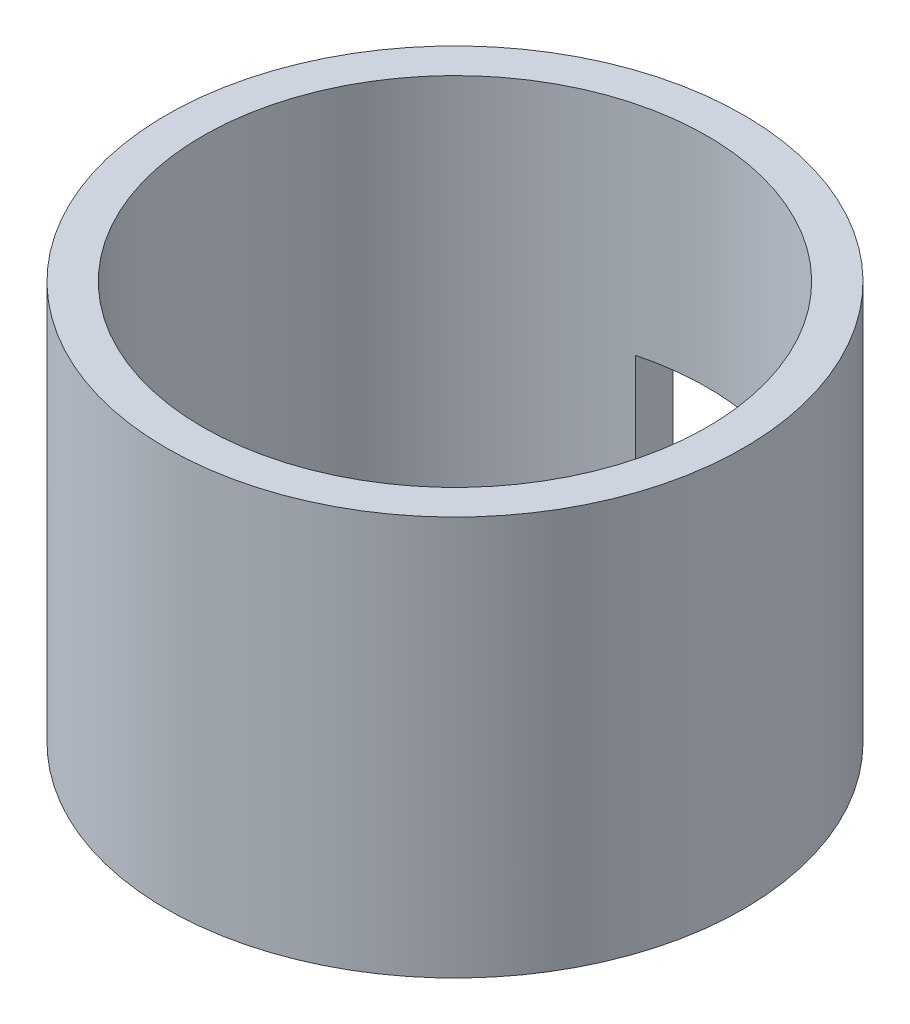
ISO-10303-21;
HEADER;
FILE_DESCRIPTION(('STEP AP214'),'2;1');
FILE_NAME('part.step','',(''),(''),'','','');
FILE_SCHEMA(('AUTOMOTIVE_DESIGN { 1 0 10303 214 1 1 1 1 }'));
ENDSEC;
DATA;
#1=APPLICATION_CONTEXT('core data for automotive mechanical design processes');
#2=APPLICATION_PROTOCOL_DEFINITION('international standard','automotive_design',2000,#1);
#3=PRODUCT_CONTEXT('',#1,'mechanical');
#4=PRODUCT('Part','Part','',(#3));
#5=PRODUCT_RELATED_PRODUCT_CATEGORY('part','',(#4));
#6=PRODUCT_DEFINITION_FORMATION('','',#4);
#7=PRODUCT_DEFINITION_CONTEXT('part definition',#1,'design');
#8=PRODUCT_DEFINITION('design','',#6,#7);
#9=PRODUCT_DEFINITION_SHAPE('','',#8);
#10=(LENGTH_UNIT() NAMED_UNIT(*) SI_UNIT(.MILLI.,.METRE.));
#11=(NAMED_UNIT(*) PLANE_ANGLE_UNIT() SI_UNIT($,.RADIAN.));
#12=(NAMED_UNIT(*) SI_UNIT($,.STERADIAN.) SOLID_ANGLE_UNIT());
#13=UNCERTAINTY_MEASURE_WITH_UNIT(LENGTH_MEASURE(1.E-05),#10,'distance_accuracy_value','');
#14=(GEOMETRIC_REPRESENTATION_CONTEXT(3) GLOBAL_UNCERTAINTY_ASSIGNED_CONTEXT((#13)) GLOBAL_UNIT_ASSIGNED_CONTEXT((#10,
#11,#12)) REPRESENTATION_CONTEXT('',''));
#15=CARTESIAN_POINT('',(0.,0.,0.));
#16=DIRECTION('',(0.,0.,1.));
#17=DIRECTION('',(1.,0.,0.));
#18=AXIS2_PLACEMENT_3D('',#15,#16,#17);
#19=CARTESIAN_POINT('',(0.,22.,0.));
#20=DIRECTION('',(0.,1.,0.));
#21=DIRECTION('',(0.,0.,1.));
#22=AXIS2_PLACEMENT_3D('',#19,#20,#21);
#23=PLANE('',#22);
#24=CARTESIAN_POINT('',(0.,22.,0.));
#25=DIRECTION('',(0.,1.,0.));
#26=DIRECTION('',(0.,0.,1.));
#27=AXIS2_PLACEMENT_3D('',#24,#25,#26);
#28=CIRCLE('',#27,15.9);
#29=CARTESIAN_POINT('',(0.,22.,15.9));
#30=VERTEX_POINT('',#29);
#31=EDGE_CURVE('E100',#30,#30,#28,.T.);
#32=ORIENTED_EDGE('',*,*,#31,.T.);
#33=EDGE_LOOP('',(#32));
#34=FACE_BOUND('',#33,.T.);
#35=CARTESIAN_POINT('',(0.,22.,0.));
#36=DIRECTION('',(0.,1.,0.));
#37=DIRECTION('',(0.,0.,1.));
#38=AXIS2_PLACEMENT_3D('',#35,#36,#37);
#39=CIRCLE('',#38,13.9);
#40=CARTESIAN_POINT('',(0.,22.,13.9));
#41=VERTEX_POINT('',#40);
#42=EDGE_CURVE('E92',#41,#41,#39,.T.);
#43=ORIENTED_EDGE('',*,*,#42,.F.);
#44=EDGE_LOOP('',(#43));
#45=FACE_BOUND('',#44,.T.);
#46=ADVANCED_FACE('F33',(#34,#45),#23,.T.);
#47=CARTESIAN_POINT('',(0.,0.,0.));
#48=DIRECTION('',(0.,1.,0.));
#49=DIRECTION('',(0.,0.,1.));
#50=AXIS2_PLACEMENT_3D('',#47,#48,#49);
#51=PLANE('',#50);
#52=CARTESIAN_POINT('',(0.,0.,0.));
#53=DIRECTION('',(0.,1.,0.));
#54=DIRECTION('',(0.,0.,1.));
#55=AXIS2_PLACEMENT_3D('',#52,#53,#54);
#56=CIRCLE('',#55,13.9);
#57=CARTESIAN_POINT('',(-3.5,0.,-13.4521373766402));
#58=VERTEX_POINT('',#57);
#59=CARTESIAN_POINT('',(3.5,0.,-13.4521373766402));
#60=VERTEX_POINT('',#59);
#61=EDGE_CURVE('E88',#58,#60,#56,.T.);
#62=ORIENTED_EDGE('',*,*,#61,.T.);
#63=DIRECTION('',(0.,0.,-1.));
#64=VECTOR('',#63,1.);
#65=CARTESIAN_POINT('',(3.5,0.,0.));
#66=LINE('',#65,#64);
#67=CARTESIAN_POINT('',(3.5,0.,-15.509996776273));
#68=VERTEX_POINT('',#67);
#69=EDGE_CURVE('E89',#60,#68,#66,.T.);
#70=ORIENTED_EDGE('',*,*,#69,.T.);
#71=CARTESIAN_POINT('',(0.,0.,0.));
#72=DIRECTION('',(0.,1.,0.));
#73=DIRECTION('',(0.,0.,1.));
#74=AXIS2_PLACEMENT_3D('',#71,#72,#73);
#75=CIRCLE('',#74,15.9);
#76=CARTESIAN_POINT('',(-3.5,0.,-15.509996776273));
#77=VERTEX_POINT('',#76);
#78=EDGE_CURVE('E87',#77,#68,#75,.T.);
#79=ORIENTED_EDGE('',*,*,#78,.F.);
#80=DIRECTION('',(0.,0.,1.));
#81=VECTOR('',#80,1.);
#82=CARTESIAN_POINT('',(-3.5,0.,0.));
#83=LINE('',#82,#81);
#84=EDGE_CURVE('E78',#77,#58,#83,.T.);
#85=ORIENTED_EDGE('',*,*,#84,.T.);
#86=EDGE_LOOP('',(#62,#70,#79,#85));
#87=FACE_BOUND('',#86,.T.);
#88=ADVANCED_FACE('F112',(#87),#51,.F.);
#89=CARTESIAN_POINT('',(0.,22.,0.));
#90=DIRECTION('',(0.,-1.,0.));
#91=DIRECTION('',(0.,0.,-1.));
#92=AXIS2_PLACEMENT_3D('',#89,#90,#91);
#93=CYLINDRICAL_SURFACE('',#92,15.9);
#94=ORIENTED_EDGE('',*,*,#78,.T.);
#95=DIRECTION('',(0.,-1.,0.));
#96=VECTOR('',#95,1.);
#97=CARTESIAN_POINT('',(3.5,22.,-15.509996776273));
#98=LINE('',#97,#96);
#99=CARTESIAN_POINT('',(3.5,10.,-15.509996776273));
#100=VERTEX_POINT('',#99);
#101=EDGE_CURVE('E54',#68,#100,#98,.F.);
#102=ORIENTED_EDGE('',*,*,#101,.T.);
#103=CARTESIAN_POINT('',(0.,10.,0.));
#104=DIRECTION('',(0.,1.,0.));
#105=DIRECTION('',(0.,0.,1.));
#106=AXIS2_PLACEMENT_3D('',#103,#104,#105);
#107=CIRCLE('',#106,15.9);
#108=CARTESIAN_POINT('',(-3.5,10.,-15.509996776273));
#109=VERTEX_POINT('',#108);
#110=EDGE_CURVE('E72',#100,#109,#107,.T.);
#111=ORIENTED_EDGE('',*,*,#110,.T.);
#112=DIRECTION('',(0.,-1.,0.));
#113=VECTOR('',#112,1.);
#114=CARTESIAN_POINT('',(-3.5,22.,-15.509996776273));
#115=LINE('',#114,#113);
#116=EDGE_CURVE('E94',#109,#77,#115,.T.);
#117=ORIENTED_EDGE('',*,*,#116,.T.);
#118=EDGE_LOOP('',(#94,#102,#111,#117));
#119=FACE_BOUND('',#118,.T.);
#120=ORIENTED_EDGE('',*,*,#31,.F.);
#121=EDGE_LOOP('',(#120));
#122=FACE_BOUND('',#121,.T.);
#123=ADVANCED_FACE('F35',(#119,#122),#93,.T.);
#124=CARTESIAN_POINT('',(0.,22.,0.));
#125=DIRECTION('',(0.,-1.,0.));
#126=DIRECTION('',(0.,0.,-1.));
#127=AXIS2_PLACEMENT_3D('',#124,#125,#126);
#128=CYLINDRICAL_SURFACE('',#127,13.9);
#129=DIRECTION('',(0.,-1.,0.));
#130=VECTOR('',#129,1.);
#131=CARTESIAN_POINT('',(3.5,22.,-13.4521373766402));
#132=LINE('',#131,#130);
#133=CARTESIAN_POINT('',(3.5,10.,-13.4521373766402));
#134=VERTEX_POINT('',#133);
#135=EDGE_CURVE('E11',#60,#134,#132,.F.);
#136=ORIENTED_EDGE('',*,*,#135,.F.);
#137=ORIENTED_EDGE('',*,*,#61,.F.);
#138=DIRECTION('',(0.,-1.,0.));
#139=VECTOR('',#138,1.);
#140=CARTESIAN_POINT('',(-3.5,22.,-13.4521373766402));
#141=LINE('',#140,#139);
#142=CARTESIAN_POINT('',(-3.5,10.,-13.4521373766402));
#143=VERTEX_POINT('',#142);
#144=EDGE_CURVE('E41',#143,#58,#141,.T.);
#145=ORIENTED_EDGE('',*,*,#144,.F.);
#146=CARTESIAN_POINT('',(0.,10.,0.));
#147=DIRECTION('',(0.,1.,0.));
#148=DIRECTION('',(0.,0.,1.));
#149=AXIS2_PLACEMENT_3D('',#146,#147,#148);
#150=CIRCLE('',#149,13.9);
#151=EDGE_CURVE('E103',#134,#143,#150,.T.);
#152=ORIENTED_EDGE('',*,*,#151,.F.);
#153=EDGE_LOOP('',(#136,#137,#145,#152));
#154=FACE_BOUND('',#153,.T.);
#155=ORIENTED_EDGE('',*,*,#42,.T.);
#156=EDGE_LOOP('',(#155));
#157=FACE_BOUND('',#156,.T.);
#158=ADVANCED_FACE('F114',(#154,#157),#128,.F.);
#159=CARTESIAN_POINT('',(3.5,-10.,-22.));
#160=DIRECTION('',(1.,0.,0.));
#161=DIRECTION('',(0.,0.,-1.));
#162=AXIS2_PLACEMENT_3D('',#159,#160,#161);
#163=PLANE('',#162);
#164=ORIENTED_EDGE('',*,*,#69,.F.);
#165=ORIENTED_EDGE('',*,*,#135,.T.);
#166=DIRECTION('',(0.,0.,1.));
#167=VECTOR('',#166,1.);
#168=CARTESIAN_POINT('',(3.5,10.,-22.));
#169=LINE('',#168,#167);
#170=EDGE_CURVE('E48',#100,#134,#169,.T.);
#171=ORIENTED_EDGE('',*,*,#170,.F.);
#172=ORIENTED_EDGE('',*,*,#101,.F.);
#173=EDGE_LOOP('',(#164,#165,#171,#172));
#174=FACE_BOUND('',#173,.T.);
#175=ADVANCED_FACE('F80',(#174),#163,.F.);
#176=CARTESIAN_POINT('',(-3.5,-10.,-22.));
#177=DIRECTION('',(-1.,0.,0.));
#178=DIRECTION('',(0.,0.,1.));
#179=AXIS2_PLACEMENT_3D('',#176,#177,#178);
#180=PLANE('',#179);
#181=DIRECTION('',(0.,0.,1.));
#182=VECTOR('',#181,1.);
#183=CARTESIAN_POINT('',(-3.5,10.,-22.));
#184=LINE('',#183,#182);
#185=EDGE_CURVE('E75',#109,#143,#184,.T.);
#186=ORIENTED_EDGE('',*,*,#185,.T.);
#187=ORIENTED_EDGE('',*,*,#144,.T.);
#188=ORIENTED_EDGE('',*,*,#84,.F.);
#189=ORIENTED_EDGE('',*,*,#116,.F.);
#190=EDGE_LOOP('',(#186,#187,#188,#189));
#191=FACE_BOUND('',#190,.T.);
#192=ADVANCED_FACE('F108',(#191),#180,.F.);
#193=CARTESIAN_POINT('',(-3.5,10.,-22.));
#194=DIRECTION('',(0.,1.,0.));
#195=DIRECTION('',(0.,0.,1.));
#196=AXIS2_PLACEMENT_3D('',#193,#194,#195);
#197=PLANE('',#196);
#198=ORIENTED_EDGE('',*,*,#170,.T.);
#199=ORIENTED_EDGE('',*,*,#151,.T.);
#200=ORIENTED_EDGE('',*,*,#185,.F.);
#201=ORIENTED_EDGE('',*,*,#110,.F.);
#202=EDGE_LOOP('',(#198,#199,#200,#201));
#203=FACE_BOUND('',#202,.T.);
#204=ADVANCED_FACE('F73',(#203),#197,.F.);
#205=CLOSED_SHELL('',(#46,#88,#123,#158,#175,#192,#204));
#206=MANIFOLD_SOLID_BREP('B2',#205);
#207=ADVANCED_BREP_SHAPE_REPRESENTATION('',(#18,#206),#14);
#208=SHAPE_DEFINITION_REPRESENTATION(#9,#207);
ENDSEC;
END-ISO-10303-21;
